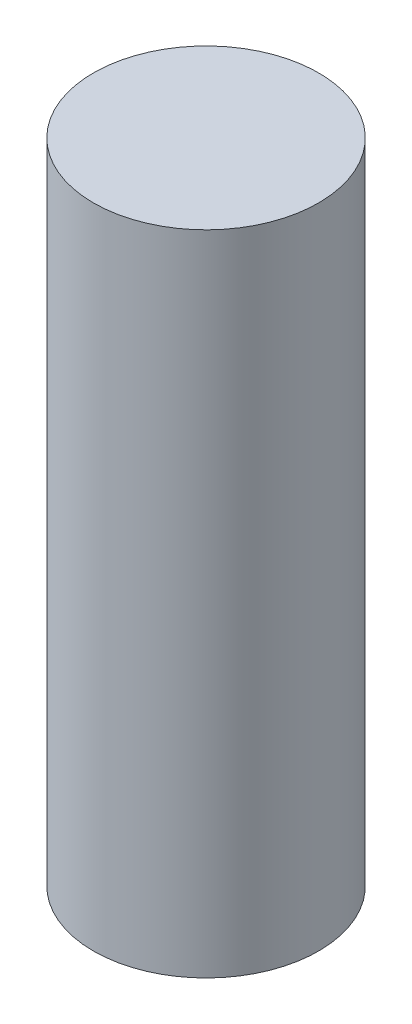
ISO-10303-21;
HEADER;
FILE_DESCRIPTION(('STEP AP214'),'2;1');
FILE_NAME('part.step','',(''),(''),'','','');
FILE_SCHEMA(('AUTOMOTIVE_DESIGN { 1 0 10303 214 1 1 1 1 }'));
ENDSEC;
DATA;
#1=APPLICATION_CONTEXT('core data for automotive mechanical design processes');
#2=APPLICATION_PROTOCOL_DEFINITION('international standard','automotive_design',2000,#1);
#3=PRODUCT_CONTEXT('',#1,'mechanical');
#4=PRODUCT('Part','Part','',(#3));
#5=PRODUCT_RELATED_PRODUCT_CATEGORY('part','',(#4));
#6=PRODUCT_DEFINITION_FORMATION('','',#4);
#7=PRODUCT_DEFINITION_CONTEXT('part definition',#1,'design');
#8=PRODUCT_DEFINITION('design','',#6,#7);
#9=PRODUCT_DEFINITION_SHAPE('','',#8);
#10=(LENGTH_UNIT() NAMED_UNIT(*) SI_UNIT(.MILLI.,.METRE.));
#11=(NAMED_UNIT(*) PLANE_ANGLE_UNIT() SI_UNIT($,.RADIAN.));
#12=(NAMED_UNIT(*) SI_UNIT($,.STERADIAN.) SOLID_ANGLE_UNIT());
#13=UNCERTAINTY_MEASURE_WITH_UNIT(LENGTH_MEASURE(1.E-05),#10,'distance_accuracy_value','');
#14=(GEOMETRIC_REPRESENTATION_CONTEXT(3) GLOBAL_UNCERTAINTY_ASSIGNED_CONTEXT((#13)) GLOBAL_UNIT_ASSIGNED_CONTEXT((#10,
#11,#12)) REPRESENTATION_CONTEXT('',''));
#15=CARTESIAN_POINT('',(0.,0.,0.));
#16=DIRECTION('',(0.,0.,1.));
#17=DIRECTION('',(1.,0.,0.));
#18=AXIS2_PLACEMENT_3D('',#15,#16,#17);
#19=CARTESIAN_POINT('',(0.,11.0744,-45.445));
#20=DIRECTION('',(0.,-1.,0.));
#21=DIRECTION('',(0.,0.,-1.));
#22=AXIS2_PLACEMENT_3D('',#19,#20,#21);
#23=CYLINDRICAL_SURFACE('',#22,1.925);
#24=CARTESIAN_POINT('',(0.,11.0744,-45.445));
#25=DIRECTION('',(0.,1.,0.));
#26=DIRECTION('',(0.,0.,1.));
#27=AXIS2_PLACEMENT_3D('',#24,#25,#26);
#28=CIRCLE('',#27,1.925);
#29=CARTESIAN_POINT('',(0.,11.0744,-43.52));
#30=VERTEX_POINT('',#29);
#31=EDGE_CURVE('E10',#30,#30,#28,.T.);
#32=ORIENTED_EDGE('',*,*,#31,.F.);
#33=EDGE_LOOP('',(#32));
#34=FACE_BOUND('',#33,.T.);
#35=CARTESIAN_POINT('',(0.,0.,-45.445));
#36=DIRECTION('',(0.,1.,0.));
#37=DIRECTION('',(0.,0.,1.));
#38=AXIS2_PLACEMENT_3D('',#35,#36,#37);
#39=CIRCLE('',#38,1.925);
#40=CARTESIAN_POINT('',(0.,0.,-43.52));
#41=VERTEX_POINT('',#40);
#42=EDGE_CURVE('E36',#41,#41,#39,.T.);
#43=ORIENTED_EDGE('',*,*,#42,.T.);
#44=EDGE_LOOP('',(#43));
#45=FACE_BOUND('',#44,.T.);
#46=ADVANCED_FACE('F33',(#34,#45),#23,.T.);
#47=CARTESIAN_POINT('',(0.,11.0744,-45.445));
#48=DIRECTION('',(0.,1.,0.));
#49=DIRECTION('',(0.,0.,1.));
#50=AXIS2_PLACEMENT_3D('',#47,#48,#49);
#51=PLANE('',#50);
#52=ORIENTED_EDGE('',*,*,#31,.T.);
#53=EDGE_LOOP('',(#52));
#54=FACE_BOUND('',#53,.T.);
#55=ADVANCED_FACE('F48',(#54),#51,.T.);
#56=CARTESIAN_POINT('',(0.,0.,-45.445));
#57=DIRECTION('',(0.,1.,0.));
#58=DIRECTION('',(0.,0.,1.));
#59=AXIS2_PLACEMENT_3D('',#56,#57,#58);
#60=PLANE('',#59);
#61=ORIENTED_EDGE('',*,*,#42,.F.);
#62=EDGE_LOOP('',(#61));
#63=FACE_BOUND('',#62,.T.);
#64=ADVANCED_FACE('F46',(#63),#60,.F.);
#65=CLOSED_SHELL('',(#46,#55,#64));
#66=MANIFOLD_SOLID_BREP('B2',#65);
#67=ADVANCED_BREP_SHAPE_REPRESENTATION('',(#18,#66),#14);
#68=SHAPE_DEFINITION_REPRESENTATION(#9,#67);
ENDSEC;
END-ISO-10303-21;
